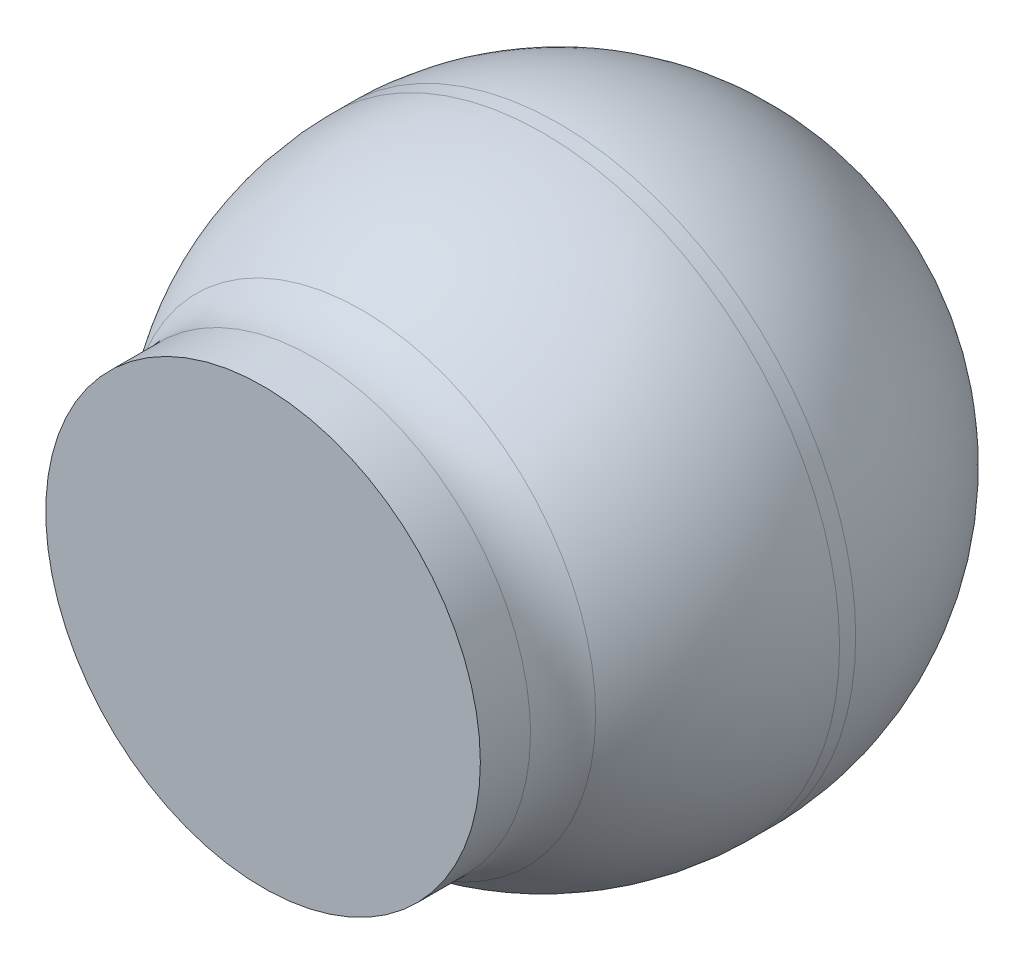
ISO-10303-21;
HEADER;
FILE_DESCRIPTION(('STEP AP214'),'2;1');
FILE_NAME('part.step','',(''),(''),'','','');
FILE_SCHEMA(('AUTOMOTIVE_DESIGN { 1 0 10303 214 1 1 1 1 }'));
ENDSEC;
DATA;
#1=APPLICATION_CONTEXT('core data for automotive mechanical design processes');
#2=APPLICATION_PROTOCOL_DEFINITION('international standard','automotive_design',2000,#1);
#3=PRODUCT_CONTEXT('',#1,'mechanical');
#4=PRODUCT('Part','Part','',(#3));
#5=PRODUCT_RELATED_PRODUCT_CATEGORY('part','',(#4));
#6=PRODUCT_DEFINITION_FORMATION('','',#4);
#7=PRODUCT_DEFINITION_CONTEXT('part definition',#1,'design');
#8=PRODUCT_DEFINITION('design','',#6,#7);
#9=PRODUCT_DEFINITION_SHAPE('','',#8);
#10=(LENGTH_UNIT() NAMED_UNIT(*) SI_UNIT(.MILLI.,.METRE.));
#11=(NAMED_UNIT(*) PLANE_ANGLE_UNIT() SI_UNIT($,.RADIAN.));
#12=(NAMED_UNIT(*) SI_UNIT($,.STERADIAN.) SOLID_ANGLE_UNIT());
#13=UNCERTAINTY_MEASURE_WITH_UNIT(LENGTH_MEASURE(1.E-05),#10,'distance_accuracy_value','');
#14=(GEOMETRIC_REPRESENTATION_CONTEXT(3) GLOBAL_UNCERTAINTY_ASSIGNED_CONTEXT((#13)) GLOBAL_UNIT_ASSIGNED_CONTEXT((#10,
#11,#12)) REPRESENTATION_CONTEXT('',''));
#15=CARTESIAN_POINT('',(0.,0.,0.));
#16=DIRECTION('',(0.,0.,1.));
#17=DIRECTION('',(1.,0.,0.));
#18=AXIS2_PLACEMENT_3D('',#15,#16,#17);
#19=CARTESIAN_POINT('',(-8.182919922269,-10.40134929145,10.006534503384));
#20=DIRECTION('',(0.,0.,-1.));
#21=DIRECTION('',(-1.,0.,0.));
#22=AXIS2_PLACEMENT_3D('',#19,#20,#21);
#23=PLANE('',#22);
#24=CARTESIAN_POINT('',(-8.182919922269,-10.40134929145,10.006534503384));
#25=DIRECTION('',(0.,0.,1.));
#26=DIRECTION('',(1.,0.,0.));
#27=AXIS2_PLACEMENT_3D('',#24,#25,#26);
#28=CIRCLE('',#27,0.275);
#29=CARTESIAN_POINT('',(-7.907919922269,-10.40134929145,10.006534503384));
#30=VERTEX_POINT('',#29);
#31=EDGE_CURVE('E20',#30,#30,#28,.F.);
#32=ORIENTED_EDGE('',*,*,#31,.F.);
#33=EDGE_LOOP('',(#32));
#34=FACE_BOUND('',#33,.T.);
#35=ADVANCED_FACE('F17',(#34),#23,.F.);
#36=CARTESIAN_POINT('',(-8.182919922269,-10.40134929145,9.906534503384));
#37=DIRECTION('',(0.,0.,1.));
#38=DIRECTION('',(1.,0.,0.));
#39=AXIS2_PLACEMENT_3D('',#36,#37,#38);
#40=CYLINDRICAL_SURFACE('',#39,0.275);
#41=CARTESIAN_POINT('',(-8.182919922269,-10.40134929145,9.943180457728));
#42=DIRECTION('',(0.,0.,-1.));
#43=DIRECTION('',(0.996700902337582,0.0811622527992467,0.));
#44=AXIS2_PLACEMENT_3D('',#41,#42,#43);
#45=CIRCLE('',#44,0.275000000000001);
#46=CARTESIAN_POINT('',(-7.90882717412616,-10.3790296719302,9.943180457728));
#47=VERTEX_POINT('',#46);
#48=EDGE_CURVE('E66',#47,#47,#45,.F.);
#49=ORIENTED_EDGE('',*,*,#48,.T.);
#50=EDGE_LOOP('',(#49));
#51=FACE_BOUND('',#50,.T.);
#52=ORIENTED_EDGE('',*,*,#31,.T.);
#53=EDGE_LOOP('',(#52));
#54=FACE_BOUND('',#53,.T.);
#55=ADVANCED_FACE('F62',(#51,#54),#40,.T.);
#56=CARTESIAN_POINT('',(-8.182919922269,-10.40134929145,9.943180457728));
#57=DIRECTION('',(0.,0.,-1.));
#58=DIRECTION('',(0.996700902337583,0.0811622527992448,0.));
#59=AXIS2_PLACEMENT_3D('',#56,#57,#58);
#60=TOROIDAL_SURFACE('',#59,0.375,0.1);
#61=ORIENTED_EDGE('',*,*,#48,.F.);
#62=EDGE_LOOP('',(#61));
#63=FACE_BOUND('',#62,.T.);
#64=CARTESIAN_POINT('',(-8.182919922269,-10.40134929145,9.881744931236));
#65=DIRECTION('',(0.,0.,-1.));
#66=DIRECTION('',(-0.99670090233869,-0.0811622527856417,0.));
#67=AXIS2_PLACEMENT_3D('',#64,#65,#66);
#68=CIRCLE('',#67,0.296097046412338);
#69=CARTESIAN_POINT('',(-8.478040115608,-10.42538119478,9.881744931236));
#70=VERTEX_POINT('',#69);
#71=EDGE_CURVE('E39',#70,#70,#68,.T.);
#72=ORIENTED_EDGE('',*,*,#71,.F.);
#73=EDGE_LOOP('',(#72));
#74=FACE_BOUND('',#73,.T.);
#75=ADVANCED_FACE('F57',(#63,#74),#60,.F.);
#76=CARTESIAN_POINT('',(-8.556682760645,-10.43178513625,9.651976062157));
#77=CARTESIAN_POINT('',(-8.556682760645,-10.43178513625,9.701461392103));
#78=CARTESIAN_POINT('',(-8.548526217348,-10.43112094157,9.750947004335));
#79=CARTESIAN_POINT('',(-8.532207085349,-10.42979205995,9.798626332798));
#80=CARTESIAN_POINT('',(-8.508341390838,-10.42784865493,9.842699544317));
#81=CARTESIAN_POINT('',(-8.478040115608,-10.42538119478,9.881744931236));
#82=(BOUNDED_CURVE() B_SPLINE_CURVE(5,(#76,#77,#78,#79,#80,#81),.UNSPECIFIED.,.F.,
.F.) B_SPLINE_CURVE_WITH_KNOTS((6,6),(0.,0.661568582165),
.UNSPECIFIED.) CURVE() GEOMETRIC_REPRESENTATION_ITEM() RATIONAL_B_SPLINE_CURVE((1.,1.,1.,1.,1.,1.)) REPRESENTATION_ITEM(''));
#83=CARTESIAN_POINT('',(-8.182919922269,-10.40134929145,9.651976062157));
#84=DIRECTION('',(0.,0.,-1.));
#85=AXIS1_PLACEMENT('',#83,#84);
#86=SURFACE_OF_REVOLUTION('',#82,#85);
#87=CARTESIAN_POINT('',(-8.182919922269,-10.40134929145,9.651976062157));
#88=DIRECTION('',(0.,0.,1.));
#89=DIRECTION('',(1.,0.,0.));
#90=AXIS2_PLACEMENT_3D('',#87,#88,#89);
#91=CIRCLE('',#90,0.375);
#92=CARTESIAN_POINT('',(-7.807919922269,-10.40134929145,9.651976062157));
#93=VERTEX_POINT('',#92);
#94=EDGE_CURVE('E36',#93,#93,#91,.F.);
#95=ORIENTED_EDGE('',*,*,#94,.F.);
#96=EDGE_LOOP('',(#95));
#97=FACE_BOUND('',#96,.T.);
#98=ORIENTED_EDGE('',*,*,#71,.T.);
#99=EDGE_LOOP('',(#98));
#100=FACE_BOUND('',#99,.T.);
#101=ADVANCED_FACE('F53',(#97,#100),#86,.F.);
#102=CARTESIAN_POINT('',(-8.182919922269,-10.40134929145,9.256534503384));
#103=DIRECTION('',(0.,0.,1.));
#104=DIRECTION('',(1.,0.,0.));
#105=AXIS2_PLACEMENT_3D('',#102,#103,#104);
#106=CYLINDRICAL_SURFACE('',#105,0.375);
#107=CARTESIAN_POINT('',(-8.182919922269,-10.40134929145,9.631534503384));
#108=DIRECTION('',(0.,0.,-1.));
#109=DIRECTION('',(0.0811622527992357,-0.996700902337583,0.));
#110=AXIS2_PLACEMENT_3D('',#107,#108,#109);
#111=CIRCLE('',#110,0.375);
#112=CARTESIAN_POINT('',(-8.15248407746929,-10.7751121298266,9.631534503384));
#113=VERTEX_POINT('',#112);
#114=CARTESIAN_POINT('',(-8.21335576706871,-10.0275864530734,9.631534503384));
#115=VERTEX_POINT('',#114);
#116=EDGE_CURVE('E11',#113,#115,#111,.T.);
#117=ORIENTED_EDGE('',*,*,#116,.F.);
#118=CARTESIAN_POINT('',(-8.182919922269,-10.40134929145,9.631534503384));
#119=DIRECTION('',(0.,0.,1.));
#120=DIRECTION('',(0.0811622527992365,-0.996700902337583,0.));
#121=AXIS2_PLACEMENT_3D('',#118,#119,#120);
#122=CIRCLE('',#121,0.375);
#123=EDGE_CURVE('E25',#115,#113,#122,.F.);
#124=ORIENTED_EDGE('',*,*,#123,.F.);
#125=EDGE_LOOP('',(#117,#124));
#126=FACE_BOUND('',#125,.T.);
#127=ORIENTED_EDGE('',*,*,#94,.T.);
#128=EDGE_LOOP('',(#127));
#129=FACE_BOUND('',#128,.T.);
#130=ADVANCED_FACE('F34',(#126,#129),#106,.T.);
#131=CARTESIAN_POINT('',(-8.182919922269,-10.40134929145,9.631534503384));
#132=DIRECTION('',(0.0811622527992361,-0.996700902337583,0.));
#133=DIRECTION('',(-0.996700902337583,-0.0811622527992361,0.));
#134=AXIS2_PLACEMENT_3D('',#131,#132,#133);
#135=SPHERICAL_SURFACE('',#134,0.375);
#136=ORIENTED_EDGE('',*,*,#123,.T.);
#137=ORIENTED_EDGE('',*,*,#116,.T.);
#138=EDGE_LOOP('',(#136,#137));
#139=FACE_BOUND('',#138,.T.);
#140=ADVANCED_FACE('F32',(#139),#135,.T.);
#141=CLOSED_SHELL('',(#35,#55,#75,#101,#130,#140));
#142=MANIFOLD_SOLID_BREP('B1',#141);
#143=ADVANCED_BREP_SHAPE_REPRESENTATION('',(#18,#142),#14);
#144=SHAPE_DEFINITION_REPRESENTATION(#9,#143);
ENDSEC;
END-ISO-10303-21;
